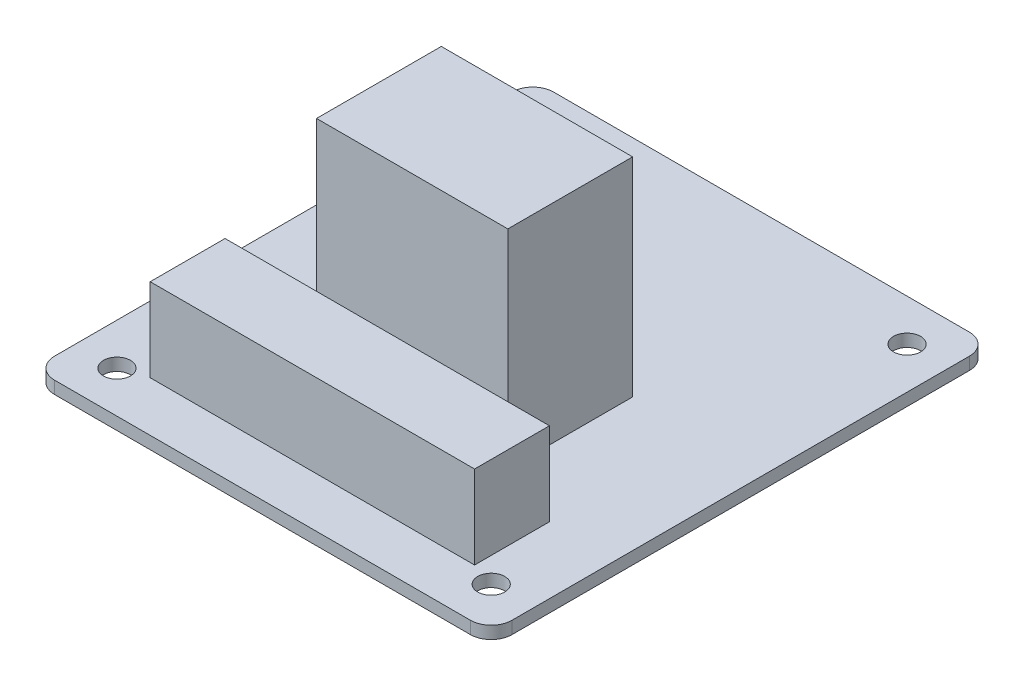
ISO-10303-21;
HEADER;
FILE_DESCRIPTION(('STEP AP214'),'2;1');
FILE_NAME('part.step','',(''),(''),'','','');
FILE_SCHEMA(('AUTOMOTIVE_DESIGN { 1 0 10303 214 1 1 1 1 }'));
ENDSEC;
DATA;
#1=APPLICATION_CONTEXT('core data for automotive mechanical design processes');
#2=APPLICATION_PROTOCOL_DEFINITION('international standard','automotive_design',2000,#1);
#3=PRODUCT_CONTEXT('',#1,'mechanical');
#4=PRODUCT('Part','Part','',(#3));
#5=PRODUCT_RELATED_PRODUCT_CATEGORY('part','',(#4));
#6=PRODUCT_DEFINITION_FORMATION('','',#4);
#7=PRODUCT_DEFINITION_CONTEXT('part definition',#1,'design');
#8=PRODUCT_DEFINITION('design','',#6,#7);
#9=PRODUCT_DEFINITION_SHAPE('','',#8);
#10=(LENGTH_UNIT() NAMED_UNIT(*) SI_UNIT(.MILLI.,.METRE.));
#11=(NAMED_UNIT(*) PLANE_ANGLE_UNIT() SI_UNIT($,.RADIAN.));
#12=(NAMED_UNIT(*) SI_UNIT($,.STERADIAN.) SOLID_ANGLE_UNIT());
#13=UNCERTAINTY_MEASURE_WITH_UNIT(LENGTH_MEASURE(1.E-05),#10,'distance_accuracy_value','');
#14=(GEOMETRIC_REPRESENTATION_CONTEXT(3) GLOBAL_UNCERTAINTY_ASSIGNED_CONTEXT((#13)) GLOBAL_UNIT_ASSIGNED_CONTEXT((#10,
#11,#12)) REPRESENTATION_CONTEXT('',''));
#15=CARTESIAN_POINT('',(0.,0.,0.));
#16=DIRECTION('',(0.,0.,1.));
#17=DIRECTION('',(1.,0.,0.));
#18=AXIS2_PLACEMENT_3D('',#15,#16,#17);
#19=CARTESIAN_POINT('',(16.,26.5,0.));
#20=DIRECTION('',(1.,0.,0.));
#21=DIRECTION('',(0.,0.,-1.));
#22=AXIS2_PLACEMENT_3D('',#19,#20,#21);
#23=PLANE('',#22);
#24=DIRECTION('',(0.,0.,1.));
#25=VECTOR('',#24,1.);
#26=CARTESIAN_POINT('',(16.,1.5,0.));
#27=LINE('',#26,#25);
#28=CARTESIAN_POINT('',(16.,1.5,-33.));
#29=VERTEX_POINT('',#28);
#30=CARTESIAN_POINT('',(16.,1.5,-18.));
#31=VERTEX_POINT('',#30);
#32=EDGE_CURVE('E113',#29,#31,#27,.T.);
#33=ORIENTED_EDGE('',*,*,#32,.T.);
#34=DIRECTION('',(0.,-1.,0.));
#35=VECTOR('',#34,1.);
#36=CARTESIAN_POINT('',(16.,26.5,-18.));
#37=LINE('',#36,#35);
#38=CARTESIAN_POINT('',(16.,26.5,-18.));
#39=VERTEX_POINT('',#38);
#40=EDGE_CURVE('E12',#39,#31,#37,.T.);
#41=ORIENTED_EDGE('',*,*,#40,.F.);
#42=DIRECTION('',(0.,0.,1.));
#43=VECTOR('',#42,1.);
#44=CARTESIAN_POINT('',(16.,26.5,0.));
#45=LINE('',#44,#43);
#46=CARTESIAN_POINT('',(16.,26.5,-33.));
#47=VERTEX_POINT('',#46);
#48=EDGE_CURVE('E90',#47,#39,#45,.T.);
#49=ORIENTED_EDGE('',*,*,#48,.F.);
#50=DIRECTION('',(0.,-1.,0.));
#51=VECTOR('',#50,1.);
#52=CARTESIAN_POINT('',(16.,26.5,-33.));
#53=LINE('',#52,#51);
#54=EDGE_CURVE('E109',#47,#29,#53,.T.);
#55=ORIENTED_EDGE('',*,*,#54,.T.);
#56=EDGE_LOOP('',(#33,#41,#49,#55));
#57=FACE_BOUND('',#56,.T.);
#58=ADVANCED_FACE('F51',(#57),#23,.F.);
#59=CARTESIAN_POINT('',(0.,26.5,-18.));
#60=DIRECTION('',(0.,0.,1.));
#61=DIRECTION('',(1.,0.,0.));
#62=AXIS2_PLACEMENT_3D('',#59,#60,#61);
#63=PLANE('',#62);
#64=DIRECTION('',(-1.,0.,0.));
#65=VECTOR('',#64,1.);
#66=CARTESIAN_POINT('',(0.,1.5,-18.));
#67=LINE('',#66,#65);
#68=CARTESIAN_POINT('',(39.,1.5,-18.));
#69=VERTEX_POINT('',#68);
#70=EDGE_CURVE('E99',#69,#31,#67,.T.);
#71=ORIENTED_EDGE('',*,*,#70,.F.);
#72=DIRECTION('',(0.,-1.,0.));
#73=VECTOR('',#72,1.);
#74=CARTESIAN_POINT('',(39.,26.5,-18.));
#75=LINE('',#74,#73);
#76=CARTESIAN_POINT('',(39.,26.5,-18.));
#77=VERTEX_POINT('',#76);
#78=EDGE_CURVE('E59',#77,#69,#75,.T.);
#79=ORIENTED_EDGE('',*,*,#78,.F.);
#80=DIRECTION('',(-1.,0.,0.));
#81=VECTOR('',#80,1.);
#82=CARTESIAN_POINT('',(0.,26.5,-18.));
#83=LINE('',#82,#81);
#84=EDGE_CURVE('E97',#77,#39,#83,.T.);
#85=ORIENTED_EDGE('',*,*,#84,.T.);
#86=ORIENTED_EDGE('',*,*,#40,.T.);
#87=EDGE_LOOP('',(#71,#79,#85,#86));
#88=FACE_BOUND('',#87,.T.);
#89=ADVANCED_FACE('F96',(#88),#63,.T.);
#90=CARTESIAN_POINT('',(39.,26.5,0.));
#91=DIRECTION('',(1.,0.,0.));
#92=DIRECTION('',(0.,0.,-1.));
#93=AXIS2_PLACEMENT_3D('',#90,#91,#92);
#94=PLANE('',#93);
#95=DIRECTION('',(0.,0.,1.));
#96=VECTOR('',#95,1.);
#97=CARTESIAN_POINT('',(39.,1.5,0.));
#98=LINE('',#97,#96);
#99=CARTESIAN_POINT('',(39.,1.5,-33.));
#100=VERTEX_POINT('',#99);
#101=EDGE_CURVE('E117',#100,#69,#98,.T.);
#102=ORIENTED_EDGE('',*,*,#101,.F.);
#103=DIRECTION('',(0.,-1.,0.));
#104=VECTOR('',#103,1.);
#105=CARTESIAN_POINT('',(39.,26.5,-33.));
#106=LINE('',#105,#104);
#107=CARTESIAN_POINT('',(39.,26.5,-33.));
#108=VERTEX_POINT('',#107);
#109=EDGE_CURVE('E82',#108,#100,#106,.T.);
#110=ORIENTED_EDGE('',*,*,#109,.F.);
#111=DIRECTION('',(0.,0.,1.));
#112=VECTOR('',#111,1.);
#113=CARTESIAN_POINT('',(39.,26.5,0.));
#114=LINE('',#113,#112);
#115=EDGE_CURVE('E105',#108,#77,#114,.T.);
#116=ORIENTED_EDGE('',*,*,#115,.T.);
#117=ORIENTED_EDGE('',*,*,#78,.T.);
#118=EDGE_LOOP('',(#102,#110,#116,#117));
#119=FACE_BOUND('',#118,.T.);
#120=ADVANCED_FACE('F107',(#119),#94,.T.);
#121=CARTESIAN_POINT('',(0.,26.5,-33.));
#122=DIRECTION('',(0.,0.,1.));
#123=DIRECTION('',(1.,0.,0.));
#124=AXIS2_PLACEMENT_3D('',#121,#122,#123);
#125=PLANE('',#124);
#126=DIRECTION('',(-1.,0.,0.));
#127=VECTOR('',#126,1.);
#128=CARTESIAN_POINT('',(0.,1.5,-33.));
#129=LINE('',#128,#127);
#130=EDGE_CURVE('E85',#100,#29,#129,.T.);
#131=ORIENTED_EDGE('',*,*,#130,.T.);
#132=ORIENTED_EDGE('',*,*,#54,.F.);
#133=DIRECTION('',(-1.,0.,0.));
#134=VECTOR('',#133,1.);
#135=CARTESIAN_POINT('',(0.,26.5,-33.));
#136=LINE('',#135,#134);
#137=EDGE_CURVE('E67',#108,#47,#136,.T.);
#138=ORIENTED_EDGE('',*,*,#137,.F.);
#139=ORIENTED_EDGE('',*,*,#109,.T.);
#140=EDGE_LOOP('',(#131,#132,#138,#139));
#141=FACE_BOUND('',#140,.T.);
#142=ADVANCED_FACE('F130',(#141),#125,.F.);
#143=CARTESIAN_POINT('',(0.,26.5,0.));
#144=DIRECTION('',(0.,-1.,0.));
#145=DIRECTION('',(0.,0.,-1.));
#146=AXIS2_PLACEMENT_3D('',#143,#144,#145);
#147=PLANE('',#146);
#148=ORIENTED_EDGE('',*,*,#48,.T.);
#149=ORIENTED_EDGE('',*,*,#84,.F.);
#150=ORIENTED_EDGE('',*,*,#115,.F.);
#151=ORIENTED_EDGE('',*,*,#137,.T.);
#152=EDGE_LOOP('',(#148,#149,#150,#151));
#153=FACE_BOUND('',#152,.T.);
#154=ADVANCED_FACE('F104',(#153),#147,.F.);
#155=CARTESIAN_POINT('',(0.,1.5,0.));
#156=DIRECTION('',(0.,-1.,0.));
#157=DIRECTION('',(0.,0.,-1.));
#158=AXIS2_PLACEMENT_3D('',#155,#156,#157);
#159=PLANE('',#158);
#160=ORIENTED_EDGE('',*,*,#32,.F.);
#161=ORIENTED_EDGE('',*,*,#130,.F.);
#162=ORIENTED_EDGE('',*,*,#101,.T.);
#163=ORIENTED_EDGE('',*,*,#70,.T.);
#164=EDGE_LOOP('',(#160,#161,#162,#163));
#165=FACE_BOUND('',#164,.T.);
#166=ADVANCED_FACE('F124',(#165),#159,.T.);
#167=CLOSED_SHELL('',(#58,#89,#120,#142,#154,#166));
#168=MANIFOLD_SOLID_BREP('B2',#167);
#169=CARTESIAN_POINT('',(8.00000000000001,11.5,0.));
#170=DIRECTION('',(-1.,0.,0.));
#171=DIRECTION('',(0.,0.,1.));
#172=AXIS2_PLACEMENT_3D('',#169,#170,#171);
#173=PLANE('',#172);
#174=DIRECTION('',(0.,0.,-1.));
#175=VECTOR('',#174,1.);
#176=CARTESIAN_POINT('',(8.00000000000001,1.5,0.));
#177=LINE('',#176,#175);
#178=CARTESIAN_POINT('',(8.,1.5,-6.));
#179=VERTEX_POINT('',#178);
#180=CARTESIAN_POINT('',(7.99999999999999,1.5,-15.));
#181=VERTEX_POINT('',#180);
#182=EDGE_CURVE('E247',#179,#181,#177,.T.);
#183=ORIENTED_EDGE('',*,*,#182,.F.);
#184=DIRECTION('',(0.,-1.,0.));
#185=VECTOR('',#184,1.);
#186=CARTESIAN_POINT('',(8.,11.5,-6.));
#187=LINE('',#186,#185);
#188=CARTESIAN_POINT('',(8.,11.5,-6.));
#189=VERTEX_POINT('',#188);
#190=EDGE_CURVE('E49',#189,#179,#187,.T.);
#191=ORIENTED_EDGE('',*,*,#190,.F.);
#192=DIRECTION('',(0.,0.,-1.));
#193=VECTOR('',#192,1.);
#194=CARTESIAN_POINT('',(8.00000000000001,11.5,0.));
#195=LINE('',#194,#193);
#196=CARTESIAN_POINT('',(7.99999999999999,11.5,-15.));
#197=VERTEX_POINT('',#196);
#198=EDGE_CURVE('E241',#189,#197,#195,.T.);
#199=ORIENTED_EDGE('',*,*,#198,.T.);
#200=DIRECTION('',(0.,-1.,0.));
#201=VECTOR('',#200,1.);
#202=CARTESIAN_POINT('',(7.99999999999999,11.5,-15.));
#203=LINE('',#202,#201);
#204=EDGE_CURVE('E186',#197,#181,#203,.T.);
#205=ORIENTED_EDGE('',*,*,#204,.T.);
#206=EDGE_LOOP('',(#183,#191,#199,#205));
#207=FACE_BOUND('',#206,.T.);
#208=ADVANCED_FACE('F183',(#207),#173,.T.);
#209=CARTESIAN_POINT('',(0.,11.5,-6.));
#210=DIRECTION('',(0.,0.,1.));
#211=DIRECTION('',(1.,0.,0.));
#212=AXIS2_PLACEMENT_3D('',#209,#210,#211);
#213=PLANE('',#212);
#214=DIRECTION('',(-1.,0.,0.));
#215=VECTOR('',#214,1.);
#216=CARTESIAN_POINT('',(0.,1.5,-6.));
#217=LINE('',#216,#215);
#218=CARTESIAN_POINT('',(47.,1.5,-6.));
#219=VERTEX_POINT('',#218);
#220=EDGE_CURVE('E243',#219,#179,#217,.T.);
#221=ORIENTED_EDGE('',*,*,#220,.F.);
#222=DIRECTION('',(0.,-1.,0.));
#223=VECTOR('',#222,1.);
#224=CARTESIAN_POINT('',(47.,11.5,-6.));
#225=LINE('',#224,#223);
#226=CARTESIAN_POINT('',(47.,11.5,-6.));
#227=VERTEX_POINT('',#226);
#228=EDGE_CURVE('E192',#227,#219,#225,.T.);
#229=ORIENTED_EDGE('',*,*,#228,.F.);
#230=DIRECTION('',(-1.,0.,0.));
#231=VECTOR('',#230,1.);
#232=CARTESIAN_POINT('',(0.,11.5,-6.));
#233=LINE('',#232,#231);
#234=EDGE_CURVE('E231',#227,#189,#233,.T.);
#235=ORIENTED_EDGE('',*,*,#234,.T.);
#236=ORIENTED_EDGE('',*,*,#190,.T.);
#237=EDGE_LOOP('',(#221,#229,#235,#236));
#238=FACE_BOUND('',#237,.T.);
#239=ADVANCED_FACE('F257',(#238),#213,.T.);
#240=CARTESIAN_POINT('',(47.,11.5,0.));
#241=DIRECTION('',(-1.,0.,0.));
#242=DIRECTION('',(0.,0.,1.));
#243=AXIS2_PLACEMENT_3D('',#240,#241,#242);
#244=PLANE('',#243);
#245=DIRECTION('',(0.,0.,-1.));
#246=VECTOR('',#245,1.);
#247=CARTESIAN_POINT('',(47.,1.5,0.));
#248=LINE('',#247,#246);
#249=CARTESIAN_POINT('',(47.,1.5,-15.));
#250=VERTEX_POINT('',#249);
#251=EDGE_CURVE('E236',#219,#250,#248,.T.);
#252=ORIENTED_EDGE('',*,*,#251,.T.);
#253=DIRECTION('',(0.,-1.,0.));
#254=VECTOR('',#253,1.);
#255=CARTESIAN_POINT('',(47.,11.5,-15.));
#256=LINE('',#255,#254);
#257=CARTESIAN_POINT('',(47.,11.5,-15.));
#258=VERTEX_POINT('',#257);
#259=EDGE_CURVE('E234',#258,#250,#256,.T.);
#260=ORIENTED_EDGE('',*,*,#259,.F.);
#261=DIRECTION('',(0.,0.,-1.));
#262=VECTOR('',#261,1.);
#263=CARTESIAN_POINT('',(47.,11.5,0.));
#264=LINE('',#263,#262);
#265=EDGE_CURVE('E228',#227,#258,#264,.T.);
#266=ORIENTED_EDGE('',*,*,#265,.F.);
#267=ORIENTED_EDGE('',*,*,#228,.T.);
#268=EDGE_LOOP('',(#252,#260,#266,#267));
#269=FACE_BOUND('',#268,.T.);
#270=ADVANCED_FACE('F235',(#269),#244,.F.);
#271=CARTESIAN_POINT('',(0.,11.5,-15.));
#272=DIRECTION('',(0.,0.,1.));
#273=DIRECTION('',(1.,0.,0.));
#274=AXIS2_PLACEMENT_3D('',#271,#272,#273);
#275=PLANE('',#274);
#276=DIRECTION('',(-1.,0.,0.));
#277=VECTOR('',#276,1.);
#278=CARTESIAN_POINT('',(0.,1.5,-15.));
#279=LINE('',#278,#277);
#280=EDGE_CURVE('E250',#250,#181,#279,.T.);
#281=ORIENTED_EDGE('',*,*,#280,.T.);
#282=ORIENTED_EDGE('',*,*,#204,.F.);
#283=DIRECTION('',(-1.,0.,0.));
#284=VECTOR('',#283,1.);
#285=CARTESIAN_POINT('',(0.,11.5,-15.));
#286=LINE('',#285,#284);
#287=EDGE_CURVE('E225',#258,#197,#286,.T.);
#288=ORIENTED_EDGE('',*,*,#287,.F.);
#289=ORIENTED_EDGE('',*,*,#259,.T.);
#290=EDGE_LOOP('',(#281,#282,#288,#289));
#291=FACE_BOUND('',#290,.T.);
#292=ADVANCED_FACE('F240',(#291),#275,.F.);
#293=CARTESIAN_POINT('',(0.,11.5,0.));
#294=DIRECTION('',(0.,1.,0.));
#295=DIRECTION('',(0.,0.,1.));
#296=AXIS2_PLACEMENT_3D('',#293,#294,#295);
#297=PLANE('',#296);
#298=ORIENTED_EDGE('',*,*,#198,.F.);
#299=ORIENTED_EDGE('',*,*,#234,.F.);
#300=ORIENTED_EDGE('',*,*,#265,.T.);
#301=ORIENTED_EDGE('',*,*,#287,.T.);
#302=EDGE_LOOP('',(#298,#299,#300,#301));
#303=FACE_BOUND('',#302,.T.);
#304=ADVANCED_FACE('F230',(#303),#297,.T.);
#305=CARTESIAN_POINT('',(0.,1.5,0.));
#306=DIRECTION('',(0.,1.,0.));
#307=DIRECTION('',(0.,0.,1.));
#308=AXIS2_PLACEMENT_3D('',#305,#306,#307);
#309=PLANE('',#308);
#310=ORIENTED_EDGE('',*,*,#182,.T.);
#311=ORIENTED_EDGE('',*,*,#280,.F.);
#312=ORIENTED_EDGE('',*,*,#251,.F.);
#313=ORIENTED_EDGE('',*,*,#220,.T.);
#314=EDGE_LOOP('',(#310,#311,#312,#313));
#315=FACE_BOUND('',#314,.T.);
#316=ADVANCED_FACE('F256',(#315),#309,.F.);
#317=CLOSED_SHELL('',(#208,#239,#270,#292,#304,#316));
#318=MANIFOLD_SOLID_BREP('B6',#317);
#319=CARTESIAN_POINT('',(2.5,1.5,-57.5));
#320=DIRECTION('',(0.,-1.,0.));
#321=DIRECTION('',(0.,0.,-1.));
#322=AXIS2_PLACEMENT_3D('',#319,#320,#321);
#323=CYLINDRICAL_SURFACE('',#322,2.5);
#324=CARTESIAN_POINT('',(2.5,0.,-57.5));
#325=DIRECTION('',(0.,1.,0.));
#326=DIRECTION('',(0.,0.,1.));
#327=AXIS2_PLACEMENT_3D('',#324,#325,#326);
#328=CIRCLE('',#327,2.5);
#329=CARTESIAN_POINT('',(0.,0.,-57.5));
#330=VERTEX_POINT('',#329);
#331=CARTESIAN_POINT('',(2.5,0.,-60.));
#332=VERTEX_POINT('',#331);
#333=EDGE_CURVE('E412',#330,#332,#328,.F.);
#334=ORIENTED_EDGE('',*,*,#333,.F.);
#335=DIRECTION('',(0.,-1.,0.));
#336=VECTOR('',#335,1.);
#337=CARTESIAN_POINT('',(0.,1.5,-57.5));
#338=LINE('',#337,#336);
#339=CARTESIAN_POINT('',(0.,1.5,-57.5));
#340=VERTEX_POINT('',#339);
#341=EDGE_CURVE('E181',#340,#330,#338,.T.);
#342=ORIENTED_EDGE('',*,*,#341,.F.);
#343=CARTESIAN_POINT('',(2.5,1.5,-57.5));
#344=DIRECTION('',(0.,1.,0.));
#345=DIRECTION('',(0.,0.,1.));
#346=AXIS2_PLACEMENT_3D('',#343,#344,#345);
#347=CIRCLE('',#346,2.5);
#348=CARTESIAN_POINT('',(2.5,1.5,-60.));
#349=VERTEX_POINT('',#348);
#350=EDGE_CURVE('E442',#340,#349,#347,.F.);
#351=ORIENTED_EDGE('',*,*,#350,.T.);
#352=DIRECTION('',(0.,-1.,0.));
#353=VECTOR('',#352,1.);
#354=CARTESIAN_POINT('',(2.5,1.5,-60.));
#355=LINE('',#354,#353);
#356=EDGE_CURVE('E322',#349,#332,#355,.T.);
#357=ORIENTED_EDGE('',*,*,#356,.T.);
#358=EDGE_LOOP('',(#334,#342,#351,#357));
#359=FACE_BOUND('',#358,.T.);
#360=ADVANCED_FACE('F306',(#359),#323,.T.);
#361=CARTESIAN_POINT('',(0.,1.5,0.));
#362=DIRECTION('',(-1.,0.,0.));
#363=DIRECTION('',(0.,0.,1.));
#364=AXIS2_PLACEMENT_3D('',#361,#362,#363);
#365=PLANE('',#364);
#366=DIRECTION('',(0.,0.,-1.));
#367=VECTOR('',#366,1.);
#368=CARTESIAN_POINT('',(0.,0.,0.));
#369=LINE('',#368,#367);
#370=CARTESIAN_POINT('',(0.,0.,-2.50000000000002));
#371=VERTEX_POINT('',#370);
#372=EDGE_CURVE('E414',#371,#330,#369,.T.);
#373=ORIENTED_EDGE('',*,*,#372,.F.);
#374=DIRECTION('',(0.,-1.,0.));
#375=VECTOR('',#374,1.);
#376=CARTESIAN_POINT('',(0.,1.5,-2.50000000000002));
#377=LINE('',#376,#375);
#378=CARTESIAN_POINT('',(0.,1.5,-2.50000000000002));
#379=VERTEX_POINT('',#378);
#380=EDGE_CURVE('E314',#379,#371,#377,.T.);
#381=ORIENTED_EDGE('',*,*,#380,.F.);
#382=DIRECTION('',(0.,0.,-1.));
#383=VECTOR('',#382,1.);
#384=CARTESIAN_POINT('',(0.,1.5,0.));
#385=LINE('',#384,#383);
#386=EDGE_CURVE('E476',#379,#340,#385,.T.);
#387=ORIENTED_EDGE('',*,*,#386,.T.);
#388=ORIENTED_EDGE('',*,*,#341,.T.);
#389=EDGE_LOOP('',(#373,#381,#387,#388));
#390=FACE_BOUND('',#389,.T.);
#391=ADVANCED_FACE('F460',(#390),#365,.T.);
#392=CARTESIAN_POINT('',(2.5,1.5,-2.5));
#393=DIRECTION('',(0.,-1.,0.));
#394=DIRECTION('',(0.,0.,-1.));
#395=AXIS2_PLACEMENT_3D('',#392,#393,#394);
#396=CYLINDRICAL_SURFACE('',#395,2.5);
#397=CARTESIAN_POINT('',(2.5,0.,-2.5));
#398=DIRECTION('',(0.,1.,0.));
#399=DIRECTION('',(0.,0.,1.));
#400=AXIS2_PLACEMENT_3D('',#397,#398,#399);
#401=CIRCLE('',#400,2.5);
#402=CARTESIAN_POINT('',(2.50000000000002,0.,0.));
#403=VERTEX_POINT('',#402);
#404=EDGE_CURVE('E417',#403,#371,#401,.F.);
#405=ORIENTED_EDGE('',*,*,#404,.F.);
#406=DIRECTION('',(0.,-1.,0.));
#407=VECTOR('',#406,1.);
#408=CARTESIAN_POINT('',(2.50000000000002,1.5,0.));
#409=LINE('',#408,#407);
#410=CARTESIAN_POINT('',(2.50000000000002,1.5,0.));
#411=VERTEX_POINT('',#410);
#412=EDGE_CURVE('E449',#411,#403,#409,.T.);
#413=ORIENTED_EDGE('',*,*,#412,.F.);
#414=CARTESIAN_POINT('',(2.5,1.5,-2.5));
#415=DIRECTION('',(0.,1.,0.));
#416=DIRECTION('',(0.,0.,1.));
#417=AXIS2_PLACEMENT_3D('',#414,#415,#416);
#418=CIRCLE('',#417,2.5);
#419=EDGE_CURVE('E456',#411,#379,#418,.F.);
#420=ORIENTED_EDGE('',*,*,#419,.T.);
#421=ORIENTED_EDGE('',*,*,#380,.T.);
#422=EDGE_LOOP('',(#405,#413,#420,#421));
#423=FACE_BOUND('',#422,.T.);
#424=ADVANCED_FACE('F454',(#423),#396,.T.);
#425=CARTESIAN_POINT('',(0.,1.5,0.));
#426=DIRECTION('',(0.,0.,-1.));
#427=DIRECTION('',(-1.,0.,0.));
#428=AXIS2_PLACEMENT_3D('',#425,#426,#427);
#429=PLANE('',#428);
#430=DIRECTION('',(1.,0.,0.));
#431=VECTOR('',#430,1.);
#432=CARTESIAN_POINT('',(0.,0.,0.));
#433=LINE('',#432,#431);
#434=CARTESIAN_POINT('',(52.5,0.,0.));
#435=VERTEX_POINT('',#434);
#436=EDGE_CURVE('E420',#403,#435,#433,.T.);
#437=ORIENTED_EDGE('',*,*,#436,.T.);
#438=DIRECTION('',(0.,-1.,0.));
#439=VECTOR('',#438,1.);
#440=CARTESIAN_POINT('',(52.5,1.5,0.));
#441=LINE('',#440,#439);
#442=CARTESIAN_POINT('',(52.5,1.5,0.));
#443=VERTEX_POINT('',#442);
#444=EDGE_CURVE('E446',#443,#435,#441,.T.);
#445=ORIENTED_EDGE('',*,*,#444,.F.);
#446=DIRECTION('',(1.,0.,0.));
#447=VECTOR('',#446,1.);
#448=CARTESIAN_POINT('',(0.,1.5,0.));
#449=LINE('',#448,#447);
#450=EDGE_CURVE('E472',#411,#443,#449,.T.);
#451=ORIENTED_EDGE('',*,*,#450,.F.);
#452=ORIENTED_EDGE('',*,*,#412,.T.);
#453=EDGE_LOOP('',(#437,#445,#451,#452));
#454=FACE_BOUND('',#453,.T.);
#455=ADVANCED_FACE('F468',(#454),#429,.F.);
#456=CARTESIAN_POINT('',(52.5,1.5,-2.5));
#457=DIRECTION('',(0.,-1.,0.));
#458=DIRECTION('',(0.,0.,-1.));
#459=AXIS2_PLACEMENT_3D('',#456,#457,#458);
#460=CYLINDRICAL_SURFACE('',#459,2.5);
#461=CARTESIAN_POINT('',(52.5,0.,-2.5));
#462=DIRECTION('',(0.,1.,0.));
#463=DIRECTION('',(0.,0.,1.));
#464=AXIS2_PLACEMENT_3D('',#461,#462,#463);
#465=CIRCLE('',#464,2.5);
#466=CARTESIAN_POINT('',(55.,0.,-2.5));
#467=VERTEX_POINT('',#466);
#468=EDGE_CURVE('E422',#435,#467,#465,.T.);
#469=ORIENTED_EDGE('',*,*,#468,.T.);
#470=DIRECTION('',(0.,-1.,0.));
#471=VECTOR('',#470,1.);
#472=CARTESIAN_POINT('',(55.,1.5,-2.5));
#473=LINE('',#472,#471);
#474=CARTESIAN_POINT('',(55.,1.5,-2.5));
#475=VERTEX_POINT('',#474);
#476=EDGE_CURVE('E392',#475,#467,#473,.T.);
#477=ORIENTED_EDGE('',*,*,#476,.F.);
#478=CARTESIAN_POINT('',(52.5,1.5,-2.5));
#479=DIRECTION('',(0.,1.,0.));
#480=DIRECTION('',(0.,0.,1.));
#481=AXIS2_PLACEMENT_3D('',#478,#479,#480);
#482=CIRCLE('',#481,2.5);
#483=EDGE_CURVE('E380',#443,#475,#482,.T.);
#484=ORIENTED_EDGE('',*,*,#483,.F.);
#485=ORIENTED_EDGE('',*,*,#444,.T.);
#486=EDGE_LOOP('',(#469,#477,#484,#485));
#487=FACE_BOUND('',#486,.T.);
#488=ADVANCED_FACE('F471',(#487),#460,.T.);
#489=CARTESIAN_POINT('',(55.,1.5,0.));
#490=DIRECTION('',(-1.,0.,0.));
#491=DIRECTION('',(0.,0.,1.));
#492=AXIS2_PLACEMENT_3D('',#489,#490,#491);
#493=PLANE('',#492);
#494=DIRECTION('',(0.,0.,-1.));
#495=VECTOR('',#494,1.);
#496=CARTESIAN_POINT('',(55.,0.,0.));
#497=LINE('',#496,#495);
#498=CARTESIAN_POINT('',(55.,0.,-57.5));
#499=VERTEX_POINT('',#498);
#500=EDGE_CURVE('E389',#467,#499,#497,.T.);
#501=ORIENTED_EDGE('',*,*,#500,.T.);
#502=DIRECTION('',(0.,-1.,0.));
#503=VECTOR('',#502,1.);
#504=CARTESIAN_POINT('',(55.,1.5,-57.5));
#505=LINE('',#504,#503);
#506=CARTESIAN_POINT('',(55.,1.5,-57.5));
#507=VERTEX_POINT('',#506);
#508=EDGE_CURVE('E386',#507,#499,#505,.T.);
#509=ORIENTED_EDGE('',*,*,#508,.F.);
#510=DIRECTION('',(0.,0.,-1.));
#511=VECTOR('',#510,1.);
#512=CARTESIAN_POINT('',(55.,1.5,0.));
#513=LINE('',#512,#511);
#514=EDGE_CURVE('E372',#475,#507,#513,.T.);
#515=ORIENTED_EDGE('',*,*,#514,.F.);
#516=ORIENTED_EDGE('',*,*,#476,.T.);
#517=EDGE_LOOP('',(#501,#509,#515,#516));
#518=FACE_BOUND('',#517,.T.);
#519=ADVANCED_FACE('F387',(#518),#493,.F.);
#520=CARTESIAN_POINT('',(52.5,1.5,-57.5));
#521=DIRECTION('',(0.,-1.,0.));
#522=DIRECTION('',(0.,0.,-1.));
#523=AXIS2_PLACEMENT_3D('',#520,#521,#522);
#524=CYLINDRICAL_SURFACE('',#523,2.5);
#525=CARTESIAN_POINT('',(52.5,0.,-57.5));
#526=DIRECTION('',(0.,1.,0.));
#527=DIRECTION('',(0.,0.,1.));
#528=AXIS2_PLACEMENT_3D('',#525,#526,#527);
#529=CIRCLE('',#528,2.5);
#530=CARTESIAN_POINT('',(52.5,0.,-60.));
#531=VERTEX_POINT('',#530);
#532=EDGE_CURVE('E425',#531,#499,#529,.F.);
#533=ORIENTED_EDGE('',*,*,#532,.F.);
#534=DIRECTION('',(0.,-1.,0.));
#535=VECTOR('',#534,1.);
#536=CARTESIAN_POINT('',(52.5,1.5,-60.));
#537=LINE('',#536,#535);
#538=CARTESIAN_POINT('',(52.5,1.5,-60.));
#539=VERTEX_POINT('',#538);
#540=EDGE_CURVE('E347',#539,#531,#537,.T.);
#541=ORIENTED_EDGE('',*,*,#540,.F.);
#542=CARTESIAN_POINT('',(52.5,1.5,-57.5));
#543=DIRECTION('',(0.,1.,0.));
#544=DIRECTION('',(0.,0.,1.));
#545=AXIS2_PLACEMENT_3D('',#542,#543,#544);
#546=CIRCLE('',#545,2.5);
#547=EDGE_CURVE('E378',#539,#507,#546,.F.);
#548=ORIENTED_EDGE('',*,*,#547,.T.);
#549=ORIENTED_EDGE('',*,*,#508,.T.);
#550=EDGE_LOOP('',(#533,#541,#548,#549));
#551=FACE_BOUND('',#550,.T.);
#552=ADVANCED_FACE('F394',(#551),#524,.T.);
#553=CARTESIAN_POINT('',(50.,1.5,-55.));
#554=DIRECTION('',(0.,-1.,0.));
#555=DIRECTION('',(0.,0.,-1.));
#556=AXIS2_PLACEMENT_3D('',#553,#554,#555);
#557=CYLINDRICAL_SURFACE('',#556,1.625);
#558=CARTESIAN_POINT('',(50.,1.5,-55.));
#559=DIRECTION('',(0.,1.,0.));
#560=DIRECTION('',(0.,0.,1.));
#561=AXIS2_PLACEMENT_3D('',#558,#559,#560);
#562=CIRCLE('',#561,1.625);
#563=CARTESIAN_POINT('',(50.,1.5,-53.375));
#564=VERTEX_POINT('',#563);
#565=EDGE_CURVE('E406',#564,#564,#562,.T.);
#566=ORIENTED_EDGE('',*,*,#565,.T.);
#567=EDGE_LOOP('',(#566));
#568=FACE_BOUND('',#567,.T.);
#569=CARTESIAN_POINT('',(50.,0.,-55.));
#570=DIRECTION('',(0.,1.,0.));
#571=DIRECTION('',(0.,0.,1.));
#572=AXIS2_PLACEMENT_3D('',#569,#570,#571);
#573=CIRCLE('',#572,1.625);
#574=CARTESIAN_POINT('',(50.,0.,-53.375));
#575=VERTEX_POINT('',#574);
#576=EDGE_CURVE('E436',#575,#575,#573,.T.);
#577=ORIENTED_EDGE('',*,*,#576,.F.);
#578=EDGE_LOOP('',(#577));
#579=FACE_BOUND('',#578,.T.);
#580=ADVANCED_FACE('F508',(#568,#579),#557,.F.);
#581=CARTESIAN_POINT('',(5.,1.5,-5.));
#582=DIRECTION('',(0.,-1.,0.));
#583=DIRECTION('',(0.,0.,-1.));
#584=AXIS2_PLACEMENT_3D('',#581,#582,#583);
#585=CYLINDRICAL_SURFACE('',#584,1.625);
#586=CARTESIAN_POINT('',(5.,1.5,-5.));
#587=DIRECTION('',(0.,1.,0.));
#588=DIRECTION('',(0.,0.,1.));
#589=AXIS2_PLACEMENT_3D('',#586,#587,#588);
#590=CIRCLE('',#589,1.625);
#591=CARTESIAN_POINT('',(5.,1.5,-3.375));
#592=VERTEX_POINT('',#591);
#593=EDGE_CURVE('E403',#592,#592,#590,.T.);
#594=ORIENTED_EDGE('',*,*,#593,.T.);
#595=EDGE_LOOP('',(#594));
#596=FACE_BOUND('',#595,.T.);
#597=CARTESIAN_POINT('',(5.,0.,-5.));
#598=DIRECTION('',(0.,1.,0.));
#599=DIRECTION('',(0.,0.,1.));
#600=AXIS2_PLACEMENT_3D('',#597,#598,#599);
#601=CIRCLE('',#600,1.625);
#602=CARTESIAN_POINT('',(5.,0.,-3.375));
#603=VERTEX_POINT('',#602);
#604=EDGE_CURVE('E433',#603,#603,#601,.T.);
#605=ORIENTED_EDGE('',*,*,#604,.F.);
#606=EDGE_LOOP('',(#605));
#607=FACE_BOUND('',#606,.T.);
#608=ADVANCED_FACE('F489',(#596,#607),#585,.F.);
#609=CARTESIAN_POINT('',(50.,1.5,-5.));
#610=DIRECTION('',(0.,-1.,0.));
#611=DIRECTION('',(0.,0.,-1.));
#612=AXIS2_PLACEMENT_3D('',#609,#610,#611);
#613=CYLINDRICAL_SURFACE('',#612,1.625);
#614=CARTESIAN_POINT('',(50.,1.5,-5.));
#615=DIRECTION('',(0.,1.,0.));
#616=DIRECTION('',(0.,0.,1.));
#617=AXIS2_PLACEMENT_3D('',#614,#615,#616);
#618=CIRCLE('',#617,1.625);
#619=CARTESIAN_POINT('',(50.,1.5,-3.375));
#620=VERTEX_POINT('',#619);
#621=EDGE_CURVE('E397',#620,#620,#618,.F.);
#622=ORIENTED_EDGE('',*,*,#621,.F.);
#623=EDGE_LOOP('',(#622));
#624=FACE_BOUND('',#623,.T.);
#625=CARTESIAN_POINT('',(50.,0.,-5.));
#626=DIRECTION('',(0.,1.,0.));
#627=DIRECTION('',(0.,0.,1.));
#628=AXIS2_PLACEMENT_3D('',#625,#626,#627);
#629=CIRCLE('',#628,1.625);
#630=CARTESIAN_POINT('',(50.,0.,-3.375));
#631=VERTEX_POINT('',#630);
#632=EDGE_CURVE('E430',#631,#631,#629,.F.);
#633=ORIENTED_EDGE('',*,*,#632,.T.);
#634=EDGE_LOOP('',(#633));
#635=FACE_BOUND('',#634,.T.);
#636=ADVANCED_FACE('F481',(#624,#635),#613,.F.);
#637=CARTESIAN_POINT('',(0.,1.5,-60.));
#638=DIRECTION('',(0.,0.,-1.));
#639=DIRECTION('',(-1.,0.,0.));
#640=AXIS2_PLACEMENT_3D('',#637,#638,#639);
#641=PLANE('',#640);
#642=DIRECTION('',(1.,0.,0.));
#643=VECTOR('',#642,1.);
#644=CARTESIAN_POINT('',(0.,0.,-60.));
#645=LINE('',#644,#643);
#646=EDGE_CURVE('E427',#332,#531,#645,.T.);
#647=ORIENTED_EDGE('',*,*,#646,.F.);
#648=ORIENTED_EDGE('',*,*,#356,.F.);
#649=DIRECTION('',(1.,0.,0.));
#650=VECTOR('',#649,1.);
#651=CARTESIAN_POINT('',(0.,1.5,-60.));
#652=LINE('',#651,#650);
#653=EDGE_CURVE('E395',#349,#539,#652,.T.);
#654=ORIENTED_EDGE('',*,*,#653,.T.);
#655=ORIENTED_EDGE('',*,*,#540,.T.);
#656=EDGE_LOOP('',(#647,#648,#654,#655));
#657=FACE_BOUND('',#656,.T.);
#658=ADVANCED_FACE('F478',(#657),#641,.T.);
#659=CARTESIAN_POINT('',(5.,1.5,-55.));
#660=DIRECTION('',(0.,-1.,0.));
#661=DIRECTION('',(0.,0.,-1.));
#662=AXIS2_PLACEMENT_3D('',#659,#660,#661);
#663=CYLINDRICAL_SURFACE('',#662,1.625);
#664=CARTESIAN_POINT('',(5.,1.5,-55.));
#665=DIRECTION('',(0.,1.,0.));
#666=DIRECTION('',(0.,0.,1.));
#667=AXIS2_PLACEMENT_3D('',#664,#665,#666);
#668=CIRCLE('',#667,1.625);
#669=CARTESIAN_POINT('',(5.,1.5,-53.375));
#670=VERTEX_POINT('',#669);
#671=EDGE_CURVE('E409',#670,#670,#668,.F.);
#672=ORIENTED_EDGE('',*,*,#671,.F.);
#673=EDGE_LOOP('',(#672));
#674=FACE_BOUND('',#673,.T.);
#675=CARTESIAN_POINT('',(5.,0.,-55.));
#676=DIRECTION('',(0.,1.,0.));
#677=DIRECTION('',(0.,0.,1.));
#678=AXIS2_PLACEMENT_3D('',#675,#676,#677);
#679=CIRCLE('',#678,1.625);
#680=CARTESIAN_POINT('',(5.,0.,-53.375));
#681=VERTEX_POINT('',#680);
#682=EDGE_CURVE('E439',#681,#681,#679,.F.);
#683=ORIENTED_EDGE('',*,*,#682,.T.);
#684=EDGE_LOOP('',(#683));
#685=FACE_BOUND('',#684,.T.);
#686=ADVANCED_FACE('F480',(#674,#685),#663,.F.);
#687=CARTESIAN_POINT('',(0.,1.5,0.));
#688=DIRECTION('',(0.,1.,0.));
#689=DIRECTION('',(0.,0.,1.));
#690=AXIS2_PLACEMENT_3D('',#687,#688,#689);
#691=PLANE('',#690);
#692=ORIENTED_EDGE('',*,*,#350,.F.);
#693=ORIENTED_EDGE('',*,*,#386,.F.);
#694=ORIENTED_EDGE('',*,*,#419,.F.);
#695=ORIENTED_EDGE('',*,*,#450,.T.);
#696=ORIENTED_EDGE('',*,*,#483,.T.);
#697=ORIENTED_EDGE('',*,*,#514,.T.);
#698=ORIENTED_EDGE('',*,*,#547,.F.);
#699=ORIENTED_EDGE('',*,*,#653,.F.);
#700=EDGE_LOOP('',(#692,#693,#694,#695,#696,#697,#698,#699));
#701=FACE_BOUND('',#700,.T.);
#702=ORIENTED_EDGE('',*,*,#621,.T.);
#703=EDGE_LOOP('',(#702));
#704=FACE_BOUND('',#703,.T.);
#705=ORIENTED_EDGE('',*,*,#593,.F.);
#706=EDGE_LOOP('',(#705));
#707=FACE_BOUND('',#706,.T.);
#708=ORIENTED_EDGE('',*,*,#565,.F.);
#709=EDGE_LOOP('',(#708));
#710=FACE_BOUND('',#709,.T.);
#711=ORIENTED_EDGE('',*,*,#671,.T.);
#712=EDGE_LOOP('',(#711));
#713=FACE_BOUND('',#712,.T.);
#714=ADVANCED_FACE('F374',(#701,#704,#707,#710,#713),#691,.T.);
#715=CARTESIAN_POINT('',(0.,0.,0.));
#716=DIRECTION('',(0.,1.,0.));
#717=DIRECTION('',(0.,0.,1.));
#718=AXIS2_PLACEMENT_3D('',#715,#716,#717);
#719=PLANE('',#718);
#720=ORIENTED_EDGE('',*,*,#333,.T.);
#721=ORIENTED_EDGE('',*,*,#646,.T.);
#722=ORIENTED_EDGE('',*,*,#532,.T.);
#723=ORIENTED_EDGE('',*,*,#500,.F.);
#724=ORIENTED_EDGE('',*,*,#468,.F.);
#725=ORIENTED_EDGE('',*,*,#436,.F.);
#726=ORIENTED_EDGE('',*,*,#404,.T.);
#727=ORIENTED_EDGE('',*,*,#372,.T.);
#728=EDGE_LOOP('',(#720,#721,#722,#723,#724,#725,#726,#727));
#729=FACE_BOUND('',#728,.T.);
#730=ORIENTED_EDGE('',*,*,#632,.F.);
#731=EDGE_LOOP('',(#730));
#732=FACE_BOUND('',#731,.T.);
#733=ORIENTED_EDGE('',*,*,#604,.T.);
#734=EDGE_LOOP('',(#733));
#735=FACE_BOUND('',#734,.T.);
#736=ORIENTED_EDGE('',*,*,#576,.T.);
#737=EDGE_LOOP('',(#736));
#738=FACE_BOUND('',#737,.T.);
#739=ORIENTED_EDGE('',*,*,#682,.F.);
#740=EDGE_LOOP('',(#739));
#741=FACE_BOUND('',#740,.T.);
#742=ADVANCED_FACE('F463',(#729,#732,#735,#738,#741),#719,.F.);
#743=CLOSED_SHELL('',(#360,#391,#424,#455,#488,#519,#552,#580,#608,#636,#658,#686,#714,#742));
#744=MANIFOLD_SOLID_BREP('B43',#743);
#745=ADVANCED_BREP_SHAPE_REPRESENTATION('',(#18,#168,#318,#744),#14);
#746=SHAPE_DEFINITION_REPRESENTATION(#9,#745);
ENDSEC;
END-ISO-10303-21;
